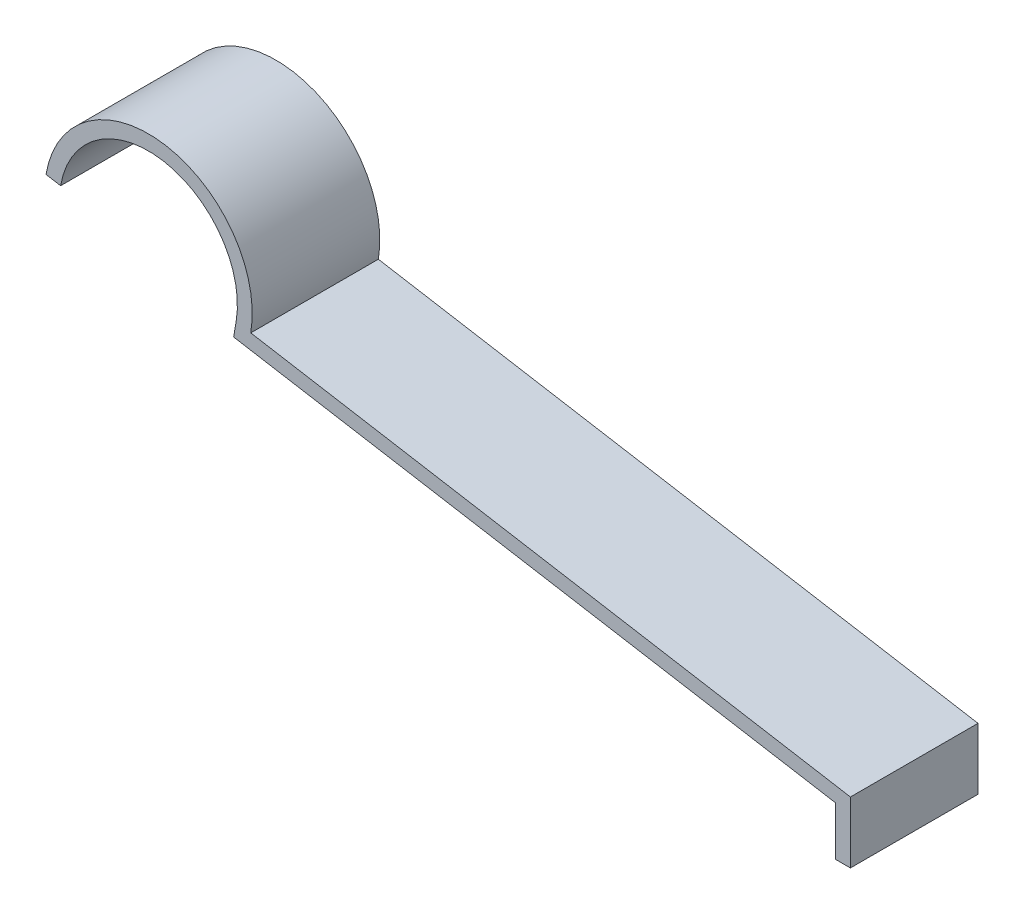
ISO-10303-21;
HEADER;
FILE_DESCRIPTION(('STEP AP214'),'2;1');
FILE_NAME('part.step','',(''),(''),'','','');
FILE_SCHEMA(('AUTOMOTIVE_DESIGN { 1 0 10303 214 1 1 1 1 }'));
ENDSEC;
DATA;
#1=APPLICATION_CONTEXT('core data for automotive mechanical design processes');
#2=APPLICATION_PROTOCOL_DEFINITION('international standard','automotive_design',2000,#1);
#3=PRODUCT_CONTEXT('',#1,'mechanical');
#4=PRODUCT('Part','Part','',(#3));
#5=PRODUCT_RELATED_PRODUCT_CATEGORY('part','',(#4));
#6=PRODUCT_DEFINITION_FORMATION('','',#4);
#7=PRODUCT_DEFINITION_CONTEXT('part definition',#1,'design');
#8=PRODUCT_DEFINITION('design','',#6,#7);
#9=PRODUCT_DEFINITION_SHAPE('','',#8);
#10=(LENGTH_UNIT() NAMED_UNIT(*) SI_UNIT(.MILLI.,.METRE.));
#11=(NAMED_UNIT(*) PLANE_ANGLE_UNIT() SI_UNIT($,.RADIAN.));
#12=(NAMED_UNIT(*) SI_UNIT($,.STERADIAN.) SOLID_ANGLE_UNIT());
#13=UNCERTAINTY_MEASURE_WITH_UNIT(LENGTH_MEASURE(1.E-05),#10,'distance_accuracy_value','');
#14=(GEOMETRIC_REPRESENTATION_CONTEXT(3) GLOBAL_UNCERTAINTY_ASSIGNED_CONTEXT((#13)) GLOBAL_UNIT_ASSIGNED_CONTEXT((#10,
#11,#12)) REPRESENTATION_CONTEXT('',''));
#15=CARTESIAN_POINT('',(0.,0.,0.));
#16=DIRECTION('',(0.,0.,1.));
#17=DIRECTION('',(1.,0.,0.));
#18=AXIS2_PLACEMENT_3D('',#15,#16,#17);
#19=CARTESIAN_POINT('',(0.5,2.07207153182528,2.15));
#20=DIRECTION('',(-1.,0.,0.));
#21=DIRECTION('',(0.,-1.,0.));
#22=AXIS2_PLACEMENT_3D('',#19,#20,#21);
#23=PLANE('',#22);
#24=DIRECTION('',(0.,0.,-1.));
#25=VECTOR('',#24,1.);
#26=CARTESIAN_POINT('',(0.5,0.,2.15));
#27=LINE('',#26,#25);
#28=CARTESIAN_POINT('',(0.5,0.,2.15));
#29=VERTEX_POINT('',#28);
#30=CARTESIAN_POINT('',(0.5,0.,-2.15));
#31=VERTEX_POINT('',#30);
#32=EDGE_CURVE('E105',#29,#31,#27,.T.);
#33=ORIENTED_EDGE('',*,*,#32,.T.);
#34=DIRECTION('',(0.,1.,0.));
#35=VECTOR('',#34,1.);
#36=CARTESIAN_POINT('',(0.5,2.07207153182528,-2.15));
#37=LINE('',#36,#35);
#38=CARTESIAN_POINT('',(0.5,2.07207153182528,-2.15));
#39=VERTEX_POINT('',#38);
#40=EDGE_CURVE('E99',#31,#39,#37,.T.);
#41=ORIENTED_EDGE('',*,*,#40,.T.);
#42=DIRECTION('',(0.,0.,-1.));
#43=VECTOR('',#42,1.);
#44=CARTESIAN_POINT('',(0.5,2.07207153182528,2.15));
#45=LINE('',#44,#43);
#46=CARTESIAN_POINT('',(0.5,2.07207153182528,2.15));
#47=VERTEX_POINT('',#46);
#48=EDGE_CURVE('E11',#47,#39,#45,.T.);
#49=ORIENTED_EDGE('',*,*,#48,.F.);
#50=DIRECTION('',(0.,1.,0.));
#51=VECTOR('',#50,1.);
#52=CARTESIAN_POINT('',(0.5,2.07207153182528,2.15));
#53=LINE('',#52,#51);
#54=EDGE_CURVE('E126',#29,#47,#53,.T.);
#55=ORIENTED_EDGE('',*,*,#54,.F.);
#56=EDGE_LOOP('',(#33,#41,#49,#55));
#57=FACE_BOUND('',#56,.T.);
#58=ADVANCED_FACE('F17',(#57),#23,.F.);
#59=CARTESIAN_POINT('',(0.5,2.07207153182528,2.15));
#60=DIRECTION('',(-0.167830352840614,-0.98581589187099,0.));
#61=DIRECTION('',(0.985815891870991,-0.167830352840614,0.));
#62=AXIS2_PLACEMENT_3D('',#59,#60,#61);
#63=PLANE('',#62);
#64=ORIENTED_EDGE('',*,*,#48,.T.);
#65=DIRECTION('',(-0.985815891870991,0.167830352840614,0.));
#66=VECTOR('',#65,1.);
#67=CARTESIAN_POINT('',(0.5,2.07207153182528,-2.15));
#68=LINE('',#67,#66);
#69=CARTESIAN_POINT('',(-19.7092257833553,5.51259376505785,-2.15));
#70=VERTEX_POINT('',#69);
#71=EDGE_CURVE('E89',#39,#70,#68,.T.);
#72=ORIENTED_EDGE('',*,*,#71,.T.);
#73=DIRECTION('',(0.,0.,-1.));
#74=VECTOR('',#73,1.);
#75=CARTESIAN_POINT('',(-19.7092257833553,5.51259376505785,2.15));
#76=LINE('',#75,#74);
#77=CARTESIAN_POINT('',(-19.7092257833553,5.51259376505785,2.15));
#78=VERTEX_POINT('',#77);
#79=EDGE_CURVE('E24',#78,#70,#76,.T.);
#80=ORIENTED_EDGE('',*,*,#79,.F.);
#81=DIRECTION('',(-0.985815891870991,0.167830352840614,0.));
#82=VECTOR('',#81,1.);
#83=CARTESIAN_POINT('',(0.5,2.07207153182528,2.15));
#84=LINE('',#83,#82);
#85=EDGE_CURVE('E90',#47,#78,#84,.T.);
#86=ORIENTED_EDGE('',*,*,#85,.F.);
#87=EDGE_LOOP('',(#64,#72,#80,#86));
#88=FACE_BOUND('',#87,.T.);
#89=ADVANCED_FACE('F87',(#88),#63,.F.);
#90=CARTESIAN_POINT('',(-23.1595814049038,6.1,2.15));
#91=DIRECTION('',(0.,0.,-1.));
#92=DIRECTION('',(-1.,0.,0.));
#93=AXIS2_PLACEMENT_3D('',#90,#91,#92);
#94=CYLINDRICAL_SURFACE('',#93,3.5);
#95=ORIENTED_EDGE('',*,*,#79,.T.);
#96=CARTESIAN_POINT('',(-23.1595814049038,6.1,-2.15));
#97=DIRECTION('',(0.,0.,1.));
#98=DIRECTION('',(1.,0.,0.));
#99=AXIS2_PLACEMENT_3D('',#96,#97,#98);
#100=CIRCLE('',#99,3.5);
#101=CARTESIAN_POINT('',(-26.6099370264523,6.68740623494215,-2.15));
#102=VERTEX_POINT('',#101);
#103=EDGE_CURVE('E103',#70,#102,#100,.T.);
#104=ORIENTED_EDGE('',*,*,#103,.T.);
#105=DIRECTION('',(0.,0.,-1.));
#106=VECTOR('',#105,1.);
#107=CARTESIAN_POINT('',(-26.6099370264523,6.68740623494215,2.15));
#108=LINE('',#107,#106);
#109=CARTESIAN_POINT('',(-26.6099370264523,6.68740623494215,2.15));
#110=VERTEX_POINT('',#109);
#111=EDGE_CURVE('E152',#110,#102,#108,.T.);
#112=ORIENTED_EDGE('',*,*,#111,.F.);
#113=CARTESIAN_POINT('',(-23.1595814049038,6.1,2.15));
#114=DIRECTION('',(0.,0.,1.));
#115=DIRECTION('',(1.,0.,0.));
#116=AXIS2_PLACEMENT_3D('',#113,#114,#115);
#117=CIRCLE('',#116,3.5);
#118=EDGE_CURVE('E129',#78,#110,#117,.T.);
#119=ORIENTED_EDGE('',*,*,#118,.F.);
#120=EDGE_LOOP('',(#95,#104,#112,#119));
#121=FACE_BOUND('',#120,.T.);
#122=ADVANCED_FACE('F155',(#121),#94,.T.);
#123=CARTESIAN_POINT('',(-26.1170290805168,6.60349105852184,2.15));
#124=DIRECTION('',(0.167830352840614,0.98581589187099,0.));
#125=DIRECTION('',(-0.98581589187099,0.167830352840614,0.));
#126=AXIS2_PLACEMENT_3D('',#123,#124,#125);
#127=PLANE('',#126);
#128=ORIENTED_EDGE('',*,*,#111,.T.);
#129=DIRECTION('',(0.98581589187099,-0.167830352840614,0.));
#130=VECTOR('',#129,1.);
#131=CARTESIAN_POINT('',(-26.1170290805168,6.60349105852184,-2.15));
#132=LINE('',#131,#130);
#133=CARTESIAN_POINT('',(-26.1170290805168,6.60349105852184,-2.15));
#134=VERTEX_POINT('',#133);
#135=EDGE_CURVE('E109',#102,#134,#132,.T.);
#136=ORIENTED_EDGE('',*,*,#135,.T.);
#137=DIRECTION('',(0.,0.,-1.));
#138=VECTOR('',#137,1.);
#139=CARTESIAN_POINT('',(-26.1170290805168,6.60349105852184,2.15));
#140=LINE('',#139,#138);
#141=CARTESIAN_POINT('',(-26.1170290805168,6.60349105852184,2.15));
#142=VERTEX_POINT('',#141);
#143=EDGE_CURVE('E150',#142,#134,#140,.T.);
#144=ORIENTED_EDGE('',*,*,#143,.F.);
#145=DIRECTION('',(0.98581589187099,-0.167830352840614,0.));
#146=VECTOR('',#145,1.);
#147=CARTESIAN_POINT('',(-26.1170290805168,6.60349105852184,2.15));
#148=LINE('',#147,#146);
#149=EDGE_CURVE('E131',#110,#142,#148,.T.);
#150=ORIENTED_EDGE('',*,*,#149,.F.);
#151=EDGE_LOOP('',(#128,#136,#144,#150));
#152=FACE_BOUND('',#151,.T.);
#153=ADVANCED_FACE('F163',(#152),#127,.F.);
#154=CARTESIAN_POINT('',(-23.1595814049038,6.1,2.15));
#155=DIRECTION('',(0.,0.,-1.));
#156=DIRECTION('',(-1.,0.,0.));
#157=AXIS2_PLACEMENT_3D('',#154,#155,#156);
#158=CYLINDRICAL_SURFACE('',#157,3.);
#159=ORIENTED_EDGE('',*,*,#143,.T.);
#160=CARTESIAN_POINT('',(-23.1595814049038,6.1,-2.15));
#161=DIRECTION('',(0.,0.,-1.));
#162=DIRECTION('',(1.,0.,0.));
#163=AXIS2_PLACEMENT_3D('',#160,#161,#162);
#164=CIRCLE('',#163,3.);
#165=CARTESIAN_POINT('',(-20.2021337292908,5.59650894147816,-2.15));
#166=VERTEX_POINT('',#165);
#167=EDGE_CURVE('E112',#134,#166,#164,.T.);
#168=ORIENTED_EDGE('',*,*,#167,.T.);
#169=DIRECTION('',(0.,0.,-1.));
#170=VECTOR('',#169,1.);
#171=CARTESIAN_POINT('',(-20.2021337292908,5.59650894147816,2.15));
#172=LINE('',#171,#170);
#173=CARTESIAN_POINT('',(-20.2021337292908,5.59650894147816,2.15));
#174=VERTEX_POINT('',#173);
#175=EDGE_CURVE('E148',#174,#166,#172,.T.);
#176=ORIENTED_EDGE('',*,*,#175,.F.);
#177=CARTESIAN_POINT('',(-23.1595814049038,6.1,2.15));
#178=DIRECTION('',(0.,0.,-1.));
#179=DIRECTION('',(1.,0.,0.));
#180=AXIS2_PLACEMENT_3D('',#177,#178,#179);
#181=CIRCLE('',#180,3.);
#182=EDGE_CURVE('E133',#142,#174,#181,.T.);
#183=ORIENTED_EDGE('',*,*,#182,.F.);
#184=EDGE_LOOP('',(#159,#168,#176,#183));
#185=FACE_BOUND('',#184,.T.);
#186=ADVANCED_FACE('F166',(#185),#158,.F.);
#187=CARTESIAN_POINT('',(-20.2021337292908,5.59650894147816,2.15));
#188=DIRECTION('',(0.98581589187099,-0.167830352840611,0.));
#189=DIRECTION('',(0.167830352840611,0.98581589187099,0.));
#190=AXIS2_PLACEMENT_3D('',#187,#188,#189);
#191=PLANE('',#190);
#192=ORIENTED_EDGE('',*,*,#175,.T.);
#193=DIRECTION('',(-0.167830352840611,-0.985815891870991,0.));
#194=VECTOR('',#193,1.);
#195=CARTESIAN_POINT('',(-20.2021337292908,5.59650894147816,-2.15));
#196=LINE('',#195,#194);
#197=CARTESIAN_POINT('',(-20.2860489057111,5.10360099554266,-2.15));
#198=VERTEX_POINT('',#197);
#199=EDGE_CURVE('E115',#166,#198,#196,.T.);
#200=ORIENTED_EDGE('',*,*,#199,.T.);
#201=DIRECTION('',(0.,0.,-1.));
#202=VECTOR('',#201,1.);
#203=CARTESIAN_POINT('',(-20.2860489057111,5.10360099554266,2.15));
#204=LINE('',#203,#202);
#205=CARTESIAN_POINT('',(-20.2860489057111,5.10360099554266,2.15));
#206=VERTEX_POINT('',#205);
#207=EDGE_CURVE('E146',#206,#198,#204,.T.);
#208=ORIENTED_EDGE('',*,*,#207,.F.);
#209=DIRECTION('',(-0.167830352840611,-0.985815891870991,0.));
#210=VECTOR('',#209,1.);
#211=CARTESIAN_POINT('',(-20.2021337292908,5.59650894147816,2.15));
#212=LINE('',#211,#210);
#213=EDGE_CURVE('E135',#174,#206,#212,.T.);
#214=ORIENTED_EDGE('',*,*,#213,.F.);
#215=EDGE_LOOP('',(#192,#200,#208,#214));
#216=FACE_BOUND('',#215,.T.);
#217=ADVANCED_FACE('F171',(#216),#191,.F.);
#218=CARTESIAN_POINT('',(0.,1.65,2.15));
#219=DIRECTION('',(0.167830352840614,0.98581589187099,0.));
#220=DIRECTION('',(-0.985815891870991,0.167830352840614,0.));
#221=AXIS2_PLACEMENT_3D('',#218,#219,#220);
#222=PLANE('',#221);
#223=ORIENTED_EDGE('',*,*,#207,.T.);
#224=DIRECTION('',(0.98581589187099,-0.167830352840614,0.));
#225=VECTOR('',#224,1.);
#226=CARTESIAN_POINT('',(0.,1.65,-2.15));
#227=LINE('',#226,#225);
#228=CARTESIAN_POINT('',(0.,1.65,-2.15));
#229=VERTEX_POINT('',#228);
#230=EDGE_CURVE('E118',#198,#229,#227,.T.);
#231=ORIENTED_EDGE('',*,*,#230,.T.);
#232=DIRECTION('',(0.,0.,-1.));
#233=VECTOR('',#232,1.);
#234=CARTESIAN_POINT('',(0.,1.65,2.15));
#235=LINE('',#234,#233);
#236=CARTESIAN_POINT('',(0.,1.65,2.15));
#237=VERTEX_POINT('',#236);
#238=EDGE_CURVE('E144',#237,#229,#235,.T.);
#239=ORIENTED_EDGE('',*,*,#238,.F.);
#240=DIRECTION('',(0.98581589187099,-0.167830352840614,0.));
#241=VECTOR('',#240,1.);
#242=CARTESIAN_POINT('',(0.,1.65,2.15));
#243=LINE('',#242,#241);
#244=EDGE_CURVE('E137',#206,#237,#243,.T.);
#245=ORIENTED_EDGE('',*,*,#244,.F.);
#246=EDGE_LOOP('',(#223,#231,#239,#245));
#247=FACE_BOUND('',#246,.T.);
#248=ADVANCED_FACE('F175',(#247),#222,.F.);
#249=CARTESIAN_POINT('',(0.,1.65,2.15));
#250=DIRECTION('',(1.,0.,0.));
#251=DIRECTION('',(0.,0.,-1.));
#252=AXIS2_PLACEMENT_3D('',#249,#250,#251);
#253=PLANE('',#252);
#254=ORIENTED_EDGE('',*,*,#238,.T.);
#255=DIRECTION('',(0.,-1.,0.));
#256=VECTOR('',#255,1.);
#257=CARTESIAN_POINT('',(0.,1.65,-2.15));
#258=LINE('',#257,#256);
#259=CARTESIAN_POINT('',(0.,0.,-2.15));
#260=VERTEX_POINT('',#259);
#261=EDGE_CURVE('E121',#229,#260,#258,.T.);
#262=ORIENTED_EDGE('',*,*,#261,.T.);
#263=DIRECTION('',(0.,0.,-1.));
#264=VECTOR('',#263,1.);
#265=CARTESIAN_POINT('',(0.,0.,2.15));
#266=LINE('',#265,#264);
#267=CARTESIAN_POINT('',(0.,0.,2.15));
#268=VERTEX_POINT('',#267);
#269=EDGE_CURVE('E142',#268,#260,#266,.T.);
#270=ORIENTED_EDGE('',*,*,#269,.F.);
#271=DIRECTION('',(0.,-1.,0.));
#272=VECTOR('',#271,1.);
#273=CARTESIAN_POINT('',(0.,1.65,2.15));
#274=LINE('',#273,#272);
#275=EDGE_CURVE('E36',#237,#268,#274,.T.);
#276=ORIENTED_EDGE('',*,*,#275,.F.);
#277=EDGE_LOOP('',(#254,#262,#270,#276));
#278=FACE_BOUND('',#277,.T.);
#279=ADVANCED_FACE('F179',(#278),#253,.F.);
#280=CARTESIAN_POINT('',(0.,0.,2.15));
#281=DIRECTION('',(0.,1.,0.));
#282=DIRECTION('',(0.,0.,1.));
#283=AXIS2_PLACEMENT_3D('',#280,#281,#282);
#284=PLANE('',#283);
#285=ORIENTED_EDGE('',*,*,#269,.T.);
#286=DIRECTION('',(1.,0.,0.));
#287=VECTOR('',#286,1.);
#288=CARTESIAN_POINT('',(0.,0.,-2.15));
#289=LINE('',#288,#287);
#290=EDGE_CURVE('E124',#260,#31,#289,.T.);
#291=ORIENTED_EDGE('',*,*,#290,.T.);
#292=ORIENTED_EDGE('',*,*,#32,.F.);
#293=DIRECTION('',(1.,0.,0.));
#294=VECTOR('',#293,1.);
#295=CARTESIAN_POINT('',(0.,0.,2.15));
#296=LINE('',#295,#294);
#297=EDGE_CURVE('E31',#268,#29,#296,.T.);
#298=ORIENTED_EDGE('',*,*,#297,.F.);
#299=EDGE_LOOP('',(#285,#291,#292,#298));
#300=FACE_BOUND('',#299,.T.);
#301=ADVANCED_FACE('F181',(#300),#284,.F.);
#302=CARTESIAN_POINT('',(-23.1595814049038,6.1,2.15));
#303=DIRECTION('',(0.,0.,1.));
#304=DIRECTION('',(1.,0.,0.));
#305=AXIS2_PLACEMENT_3D('',#302,#303,#304);
#306=PLANE('',#305);
#307=ORIENTED_EDGE('',*,*,#54,.T.);
#308=ORIENTED_EDGE('',*,*,#85,.T.);
#309=ORIENTED_EDGE('',*,*,#118,.T.);
#310=ORIENTED_EDGE('',*,*,#149,.T.);
#311=ORIENTED_EDGE('',*,*,#182,.T.);
#312=ORIENTED_EDGE('',*,*,#213,.T.);
#313=ORIENTED_EDGE('',*,*,#244,.T.);
#314=ORIENTED_EDGE('',*,*,#275,.T.);
#315=ORIENTED_EDGE('',*,*,#297,.T.);
#316=EDGE_LOOP('',(#307,#308,#309,#310,#311,#312,#313,#314,#315));
#317=FACE_BOUND('',#316,.T.);
#318=ADVANCED_FACE('F158',(#317),#306,.T.);
#319=CARTESIAN_POINT('',(-23.1595814049038,6.1,-2.15));
#320=DIRECTION('',(0.,0.,1.));
#321=DIRECTION('',(1.,0.,0.));
#322=AXIS2_PLACEMENT_3D('',#319,#320,#321);
#323=PLANE('',#322);
#324=ORIENTED_EDGE('',*,*,#40,.F.);
#325=ORIENTED_EDGE('',*,*,#290,.F.);
#326=ORIENTED_EDGE('',*,*,#261,.F.);
#327=ORIENTED_EDGE('',*,*,#230,.F.);
#328=ORIENTED_EDGE('',*,*,#199,.F.);
#329=ORIENTED_EDGE('',*,*,#167,.F.);
#330=ORIENTED_EDGE('',*,*,#135,.F.);
#331=ORIENTED_EDGE('',*,*,#103,.F.);
#332=ORIENTED_EDGE('',*,*,#71,.F.);
#333=EDGE_LOOP('',(#324,#325,#326,#327,#328,#329,#330,#331,#332));
#334=FACE_BOUND('',#333,.T.);
#335=ADVANCED_FACE('F97',(#334),#323,.F.);
#336=CLOSED_SHELL('',(#58,#89,#122,#153,#186,#217,#248,#279,#301,#318,#335));
#337=MANIFOLD_SOLID_BREP('B1',#336);
#338=ADVANCED_BREP_SHAPE_REPRESENTATION('',(#18,#337),#14);
#339=SHAPE_DEFINITION_REPRESENTATION(#9,#338);
ENDSEC;
END-ISO-10303-21;
